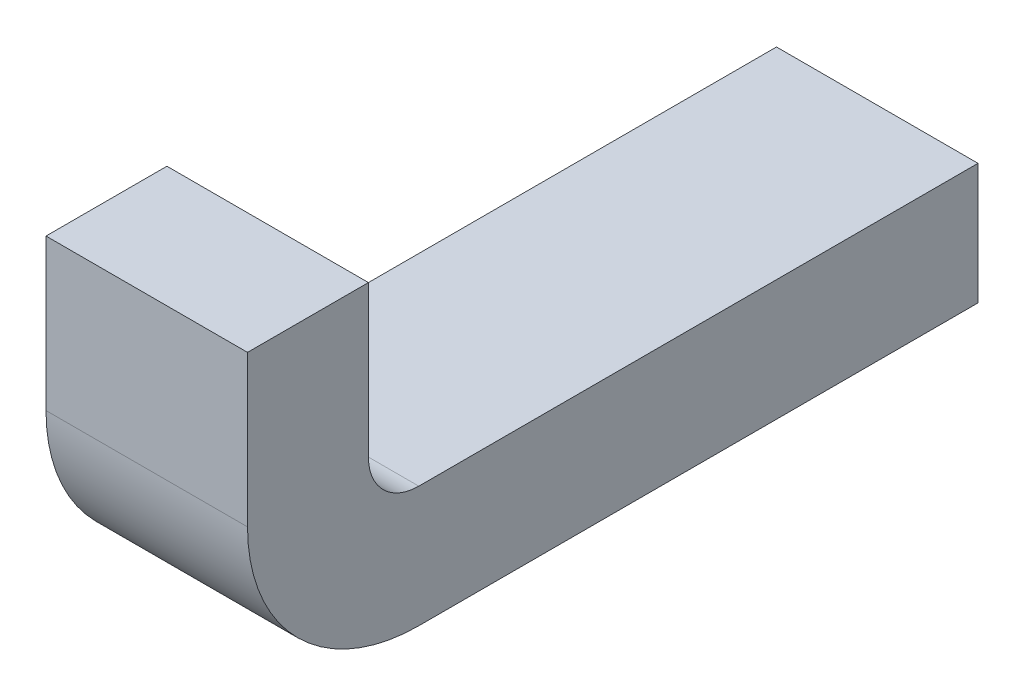
ISO-10303-21;
HEADER;
FILE_DESCRIPTION(('STEP AP214'),'2;1');
FILE_NAME('part.step','',(''),(''),'','','');
FILE_SCHEMA(('AUTOMOTIVE_DESIGN { 1 0 10303 214 1 1 1 1 }'));
ENDSEC;
DATA;
#1=APPLICATION_CONTEXT('core data for automotive mechanical design processes');
#2=APPLICATION_PROTOCOL_DEFINITION('international standard','automotive_design',2000,#1);
#3=PRODUCT_CONTEXT('',#1,'mechanical');
#4=PRODUCT('Part','Part','',(#3));
#5=PRODUCT_RELATED_PRODUCT_CATEGORY('part','',(#4));
#6=PRODUCT_DEFINITION_FORMATION('','',#4);
#7=PRODUCT_DEFINITION_CONTEXT('part definition',#1,'design');
#8=PRODUCT_DEFINITION('design','',#6,#7);
#9=PRODUCT_DEFINITION_SHAPE('','',#8);
#10=(LENGTH_UNIT() NAMED_UNIT(*) SI_UNIT(.MILLI.,.METRE.));
#11=(NAMED_UNIT(*) PLANE_ANGLE_UNIT() SI_UNIT($,.RADIAN.));
#12=(NAMED_UNIT(*) SI_UNIT($,.STERADIAN.) SOLID_ANGLE_UNIT());
#13=UNCERTAINTY_MEASURE_WITH_UNIT(LENGTH_MEASURE(1.E-05),#10,'distance_accuracy_value','');
#14=(GEOMETRIC_REPRESENTATION_CONTEXT(3) GLOBAL_UNCERTAINTY_ASSIGNED_CONTEXT((#13)) GLOBAL_UNIT_ASSIGNED_CONTEXT((#10,
#11,#12)) REPRESENTATION_CONTEXT('',''));
#15=CARTESIAN_POINT('',(0.,0.,0.));
#16=DIRECTION('',(0.,0.,1.));
#17=DIRECTION('',(1.,0.,0.));
#18=AXIS2_PLACEMENT_3D('',#15,#16,#17);
#19=CARTESIAN_POINT('',(1.15,0.,-3.300000000002));
#20=DIRECTION('',(0.,-1.,0.));
#21=DIRECTION('',(1.,0.,0.));
#22=AXIS2_PLACEMENT_3D('',#19,#20,#21);
#23=PLANE('',#22);
#24=DIRECTION('',(0.,0.,1.));
#25=VECTOR('',#24,1.);
#26=CARTESIAN_POINT('',(1.15,0.,-3.300000000002));
#27=LINE('',#26,#25);
#28=CARTESIAN_POINT('',(1.15,0.,-3.300000000002));
#29=VERTEX_POINT('',#28);
#30=CARTESIAN_POINT('',(1.15,0.,-3.854999999999));
#31=VERTEX_POINT('',#30);
#32=EDGE_CURVE('E121',#29,#31,#27,.F.);
#33=ORIENTED_EDGE('',*,*,#32,.T.);
#34=DIRECTION('',(-1.,0.,0.));
#35=VECTOR('',#34,1.);
#36=CARTESIAN_POINT('',(1.15,0.,-3.854999999999));
#37=LINE('',#36,#35);
#38=CARTESIAN_POINT('',(1.35,0.,-3.854999999999));
#39=VERTEX_POINT('',#38);
#40=EDGE_CURVE('E124',#39,#31,#37,.T.);
#41=ORIENTED_EDGE('',*,*,#40,.F.);
#42=DIRECTION('',(0.,0.,1.));
#43=VECTOR('',#42,1.);
#44=CARTESIAN_POINT('',(1.35,0.,-3.300000000002));
#45=LINE('',#44,#43);
#46=CARTESIAN_POINT('',(1.35,0.,-3.300000000002));
#47=VERTEX_POINT('',#46);
#48=EDGE_CURVE('E154',#47,#39,#45,.F.);
#49=ORIENTED_EDGE('',*,*,#48,.F.);
#50=DIRECTION('',(1.,0.,0.));
#51=VECTOR('',#50,1.);
#52=CARTESIAN_POINT('',(1.15,0.,-3.300000000002));
#53=LINE('',#52,#51);
#54=EDGE_CURVE('E63',#29,#47,#53,.T.);
#55=ORIENTED_EDGE('',*,*,#54,.F.);
#56=EDGE_LOOP('',(#33,#41,#49,#55));
#57=FACE_BOUND('',#56,.T.);
#58=ADVANCED_FACE('F16',(#57),#23,.T.);
#59=CARTESIAN_POINT('',(1.15,0.32,-3.250000000002));
#60=DIRECTION('',(0.,1.,1.246832498358E-13));
#61=DIRECTION('',(0.,-1.246832498358E-13,1.));
#62=AXIS2_PLACEMENT_3D('',#59,#60,#61);
#63=PLANE('',#62);
#64=DIRECTION('',(0.,0.,1.));
#65=VECTOR('',#64,1.);
#66=CARTESIAN_POINT('',(1.15,0.32,-3.300000000002));
#67=LINE('',#66,#65);
#68=CARTESIAN_POINT('',(1.15,0.32,-3.250000000002));
#69=VERTEX_POINT('',#68);
#70=CARTESIAN_POINT('',(1.15,0.32,-3.130000000002));
#71=VERTEX_POINT('',#70);
#72=EDGE_CURVE('E100',#69,#71,#67,.T.);
#73=ORIENTED_EDGE('',*,*,#72,.T.);
#74=DIRECTION('',(1.,0.,0.));
#75=VECTOR('',#74,1.);
#76=CARTESIAN_POINT('',(1.15,0.32,-3.130000000002));
#77=LINE('',#76,#75);
#78=CARTESIAN_POINT('',(1.35,0.32,-3.130000000002));
#79=VERTEX_POINT('',#78);
#80=EDGE_CURVE('E162',#79,#71,#77,.F.);
#81=ORIENTED_EDGE('',*,*,#80,.F.);
#82=DIRECTION('',(0.,0.,1.));
#83=VECTOR('',#82,1.);
#84=CARTESIAN_POINT('',(1.35,0.32,-3.300000000002));
#85=LINE('',#84,#83);
#86=CARTESIAN_POINT('',(1.35,0.32,-3.250000000002));
#87=VERTEX_POINT('',#86);
#88=EDGE_CURVE('E150',#87,#79,#85,.T.);
#89=ORIENTED_EDGE('',*,*,#88,.F.);
#90=DIRECTION('',(-1.,0.,0.));
#91=VECTOR('',#90,1.);
#92=CARTESIAN_POINT('',(1.15,0.32,-3.250000000002));
#93=LINE('',#92,#91);
#94=EDGE_CURVE('E72',#69,#87,#93,.F.);
#95=ORIENTED_EDGE('',*,*,#94,.F.);
#96=EDGE_LOOP('',(#73,#81,#89,#95));
#97=FACE_BOUND('',#96,.T.);
#98=ADVANCED_FACE('F182',(#97),#63,.T.);
#99=CARTESIAN_POINT('',(1.15,0.32,-3.130000000002));
#100=DIRECTION('',(0.,0.,1.));
#101=DIRECTION('',(1.,0.,0.));
#102=AXIS2_PLACEMENT_3D('',#99,#100,#101);
#103=PLANE('',#102);
#104=DIRECTION('',(0.,1.,0.));
#105=VECTOR('',#104,1.);
#106=CARTESIAN_POINT('',(1.15,0.17,-3.130000000002));
#107=LINE('',#106,#105);
#108=CARTESIAN_POINT('',(1.15,0.17,-3.130000000002));
#109=VERTEX_POINT('',#108);
#110=EDGE_CURVE('E110',#71,#109,#107,.F.);
#111=ORIENTED_EDGE('',*,*,#110,.T.);
#112=DIRECTION('',(1.,0.,0.));
#113=VECTOR('',#112,1.);
#114=CARTESIAN_POINT('',(1.15,0.17,-3.130000000002));
#115=LINE('',#114,#113);
#116=CARTESIAN_POINT('',(1.35,0.17,-3.130000000002));
#117=VERTEX_POINT('',#116);
#118=EDGE_CURVE('E57',#117,#109,#115,.F.);
#119=ORIENTED_EDGE('',*,*,#118,.F.);
#120=DIRECTION('',(0.,1.,0.));
#121=VECTOR('',#120,1.);
#122=CARTESIAN_POINT('',(1.35,0.17,-3.130000000002));
#123=LINE('',#122,#121);
#124=EDGE_CURVE('E141',#79,#117,#123,.F.);
#125=ORIENTED_EDGE('',*,*,#124,.F.);
#126=ORIENTED_EDGE('',*,*,#80,.T.);
#127=EDGE_LOOP('',(#111,#119,#125,#126));
#128=FACE_BOUND('',#127,.T.);
#129=ADVANCED_FACE('F183',(#128),#103,.T.);
#130=CARTESIAN_POINT('',(1.15,0.17,-3.300000000002));
#131=DIRECTION('',(1.,0.,0.));
#132=DIRECTION('',(0.,1.,0.));
#133=AXIS2_PLACEMENT_3D('',#130,#131,#132);
#134=CYLINDRICAL_SURFACE('',#133,0.17);
#135=CARTESIAN_POINT('',(1.15,0.17,-3.300000000002));
#136=DIRECTION('',(1.,0.,0.));
#137=DIRECTION('',(0.,1.,0.));
#138=AXIS2_PLACEMENT_3D('',#135,#136,#137);
#139=CIRCLE('',#138,0.17);
#140=EDGE_CURVE('E96',#109,#29,#139,.T.);
#141=ORIENTED_EDGE('',*,*,#140,.T.);
#142=ORIENTED_EDGE('',*,*,#54,.T.);
#143=CARTESIAN_POINT('',(1.35,0.17,-3.300000000002));
#144=DIRECTION('',(1.,0.,0.));
#145=DIRECTION('',(0.,1.,0.));
#146=AXIS2_PLACEMENT_3D('',#143,#144,#145);
#147=CIRCLE('',#146,0.17);
#148=EDGE_CURVE('E19',#117,#47,#147,.T.);
#149=ORIENTED_EDGE('',*,*,#148,.F.);
#150=ORIENTED_EDGE('',*,*,#118,.T.);
#151=EDGE_LOOP('',(#141,#142,#149,#150));
#152=FACE_BOUND('',#151,.T.);
#153=ADVANCED_FACE('F185',(#152),#134,.T.);
#154=CARTESIAN_POINT('',(1.15,0.17,-3.250000000002));
#155=DIRECTION('',(0.,0.,-1.));
#156=DIRECTION('',(-1.,0.,0.));
#157=AXIS2_PLACEMENT_3D('',#154,#155,#156);
#158=PLANE('',#157);
#159=DIRECTION('',(0.,1.,0.));
#160=VECTOR('',#159,1.);
#161=CARTESIAN_POINT('',(1.15,0.17,-3.250000000002));
#162=LINE('',#161,#160);
#163=CARTESIAN_POINT('',(1.15,0.17,-3.250000000002));
#164=VERTEX_POINT('',#163);
#165=EDGE_CURVE('E92',#164,#69,#162,.T.);
#166=ORIENTED_EDGE('',*,*,#165,.T.);
#167=ORIENTED_EDGE('',*,*,#94,.T.);
#168=DIRECTION('',(0.,1.,0.));
#169=VECTOR('',#168,1.);
#170=CARTESIAN_POINT('',(1.35,0.17,-3.250000000002));
#171=LINE('',#170,#169);
#172=CARTESIAN_POINT('',(1.35,0.17,-3.250000000002));
#173=VERTEX_POINT('',#172);
#174=EDGE_CURVE('E87',#173,#87,#171,.T.);
#175=ORIENTED_EDGE('',*,*,#174,.F.);
#176=DIRECTION('',(1.,0.,0.));
#177=VECTOR('',#176,1.);
#178=CARTESIAN_POINT('',(1.15,0.17,-3.250000000002));
#179=LINE('',#178,#177);
#180=EDGE_CURVE('E90',#173,#164,#179,.F.);
#181=ORIENTED_EDGE('',*,*,#180,.T.);
#182=EDGE_LOOP('',(#166,#167,#175,#181));
#183=FACE_BOUND('',#182,.T.);
#184=ADVANCED_FACE('F91',(#183),#158,.T.);
#185=CARTESIAN_POINT('',(1.35,0.17,-3.300000000002));
#186=DIRECTION('',(1.,0.,0.));
#187=DIRECTION('',(0.,1.,0.));
#188=AXIS2_PLACEMENT_3D('',#185,#186,#187);
#189=PLANE('',#188);
#190=ORIENTED_EDGE('',*,*,#88,.T.);
#191=ORIENTED_EDGE('',*,*,#124,.T.);
#192=ORIENTED_EDGE('',*,*,#148,.T.);
#193=ORIENTED_EDGE('',*,*,#48,.T.);
#194=DIRECTION('',(0.,1.,0.));
#195=VECTOR('',#194,1.);
#196=CARTESIAN_POINT('',(1.35,0.,-3.854999999999));
#197=LINE('',#196,#195);
#198=CARTESIAN_POINT('',(1.35,0.12,-3.854999999999));
#199=VERTEX_POINT('',#198);
#200=EDGE_CURVE('E138',#199,#39,#197,.F.);
#201=ORIENTED_EDGE('',*,*,#200,.F.);
#202=DIRECTION('',(0.,0.,1.));
#203=VECTOR('',#202,1.);
#204=CARTESIAN_POINT('',(1.35,0.12,-3.854999999999));
#205=LINE('',#204,#203);
#206=CARTESIAN_POINT('',(1.35,0.119999999999999,-3.300000000002));
#207=VERTEX_POINT('',#206);
#208=EDGE_CURVE('E107',#207,#199,#205,.F.);
#209=ORIENTED_EDGE('',*,*,#208,.F.);
#210=CARTESIAN_POINT('',(1.35,0.17,-3.300000000002));
#211=DIRECTION('',(1.,0.,0.));
#212=DIRECTION('',(0.,1.,0.));
#213=AXIS2_PLACEMENT_3D('',#210,#211,#212);
#214=CIRCLE('',#213,0.05);
#215=EDGE_CURVE('E105',#207,#173,#214,.F.);
#216=ORIENTED_EDGE('',*,*,#215,.T.);
#217=ORIENTED_EDGE('',*,*,#174,.T.);
#218=EDGE_LOOP('',(#190,#191,#192,#193,#201,#209,#216,#217));
#219=FACE_BOUND('',#218,.T.);
#220=ADVANCED_FACE('F179',(#219),#189,.T.);
#221=CARTESIAN_POINT('',(1.15,0.,-3.854999999999));
#222=DIRECTION('',(0.,0.,-1.));
#223=DIRECTION('',(-1.,0.,0.));
#224=AXIS2_PLACEMENT_3D('',#221,#222,#223);
#225=PLANE('',#224);
#226=DIRECTION('',(0.,1.,0.));
#227=VECTOR('',#226,1.);
#228=CARTESIAN_POINT('',(1.15,0.17,-3.854999999999));
#229=LINE('',#228,#227);
#230=CARTESIAN_POINT('',(1.15,0.12,-3.854999999999));
#231=VERTEX_POINT('',#230);
#232=EDGE_CURVE('E101',#31,#231,#229,.T.);
#233=ORIENTED_EDGE('',*,*,#232,.T.);
#234=DIRECTION('',(-1.,0.,0.));
#235=VECTOR('',#234,1.);
#236=CARTESIAN_POINT('',(1.15,0.12,-3.854999999999));
#237=LINE('',#236,#235);
#238=EDGE_CURVE('E128',#199,#231,#237,.T.);
#239=ORIENTED_EDGE('',*,*,#238,.F.);
#240=ORIENTED_EDGE('',*,*,#200,.T.);
#241=ORIENTED_EDGE('',*,*,#40,.T.);
#242=EDGE_LOOP('',(#233,#239,#240,#241));
#243=FACE_BOUND('',#242,.T.);
#244=ADVANCED_FACE('F204',(#243),#225,.T.);
#245=CARTESIAN_POINT('',(1.15,0.17,-3.300000000002));
#246=DIRECTION('',(1.,0.,0.));
#247=DIRECTION('',(0.,1.,0.));
#248=AXIS2_PLACEMENT_3D('',#245,#246,#247);
#249=PLANE('',#248);
#250=ORIENTED_EDGE('',*,*,#110,.F.);
#251=ORIENTED_EDGE('',*,*,#72,.F.);
#252=ORIENTED_EDGE('',*,*,#165,.F.);
#253=CARTESIAN_POINT('',(1.15,0.17,-3.300000000002));
#254=DIRECTION('',(1.,0.,0.));
#255=DIRECTION('',(0.,1.,0.));
#256=AXIS2_PLACEMENT_3D('',#253,#254,#255);
#257=CIRCLE('',#256,0.05);
#258=CARTESIAN_POINT('',(1.15,0.12,-3.300000000002));
#259=VERTEX_POINT('',#258);
#260=EDGE_CURVE('E34',#164,#259,#257,.T.);
#261=ORIENTED_EDGE('',*,*,#260,.T.);
#262=DIRECTION('',(0.,0.,1.));
#263=VECTOR('',#262,1.);
#264=CARTESIAN_POINT('',(1.15,0.12,-3.854999999999));
#265=LINE('',#264,#263);
#266=EDGE_CURVE('E25',#231,#259,#265,.T.);
#267=ORIENTED_EDGE('',*,*,#266,.F.);
#268=ORIENTED_EDGE('',*,*,#232,.F.);
#269=ORIENTED_EDGE('',*,*,#32,.F.);
#270=ORIENTED_EDGE('',*,*,#140,.F.);
#271=EDGE_LOOP('',(#250,#251,#252,#261,#267,#268,#269,#270));
#272=FACE_BOUND('',#271,.T.);
#273=ADVANCED_FACE('F99',(#272),#249,.F.);
#274=CARTESIAN_POINT('',(1.15,0.17,-3.300000000002));
#275=DIRECTION('',(1.,0.,0.));
#276=DIRECTION('',(0.,1.,0.));
#277=AXIS2_PLACEMENT_3D('',#274,#275,#276);
#278=CYLINDRICAL_SURFACE('',#277,0.05);
#279=DIRECTION('',(-1.,0.,0.));
#280=VECTOR('',#279,1.);
#281=CARTESIAN_POINT('',(1.15,0.12,-3.300000000002));
#282=LINE('',#281,#280);
#283=EDGE_CURVE('E11',#259,#207,#282,.F.);
#284=ORIENTED_EDGE('',*,*,#283,.F.);
#285=ORIENTED_EDGE('',*,*,#260,.F.);
#286=ORIENTED_EDGE('',*,*,#180,.F.);
#287=ORIENTED_EDGE('',*,*,#215,.F.);
#288=EDGE_LOOP('',(#284,#285,#286,#287));
#289=FACE_BOUND('',#288,.T.);
#290=ADVANCED_FACE('F103',(#289),#278,.F.);
#291=CARTESIAN_POINT('',(1.15,0.12,-3.854999999999));
#292=DIRECTION('',(0.,1.,0.));
#293=DIRECTION('',(-1.,0.,0.));
#294=AXIS2_PLACEMENT_3D('',#291,#292,#293);
#295=PLANE('',#294);
#296=ORIENTED_EDGE('',*,*,#266,.T.);
#297=ORIENTED_EDGE('',*,*,#283,.T.);
#298=ORIENTED_EDGE('',*,*,#208,.T.);
#299=ORIENTED_EDGE('',*,*,#238,.T.);
#300=EDGE_LOOP('',(#296,#297,#298,#299));
#301=FACE_BOUND('',#300,.T.);
#302=ADVANCED_FACE('F193',(#301),#295,.T.);
#303=CLOSED_SHELL('',(#58,#98,#129,#153,#184,#220,#244,#273,#290,#302));
#304=MANIFOLD_SOLID_BREP('B1',#303);
#305=ADVANCED_BREP_SHAPE_REPRESENTATION('',(#18,#304),#14);
#306=SHAPE_DEFINITION_REPRESENTATION(#9,#305);
ENDSEC;
END-ISO-10303-21;
